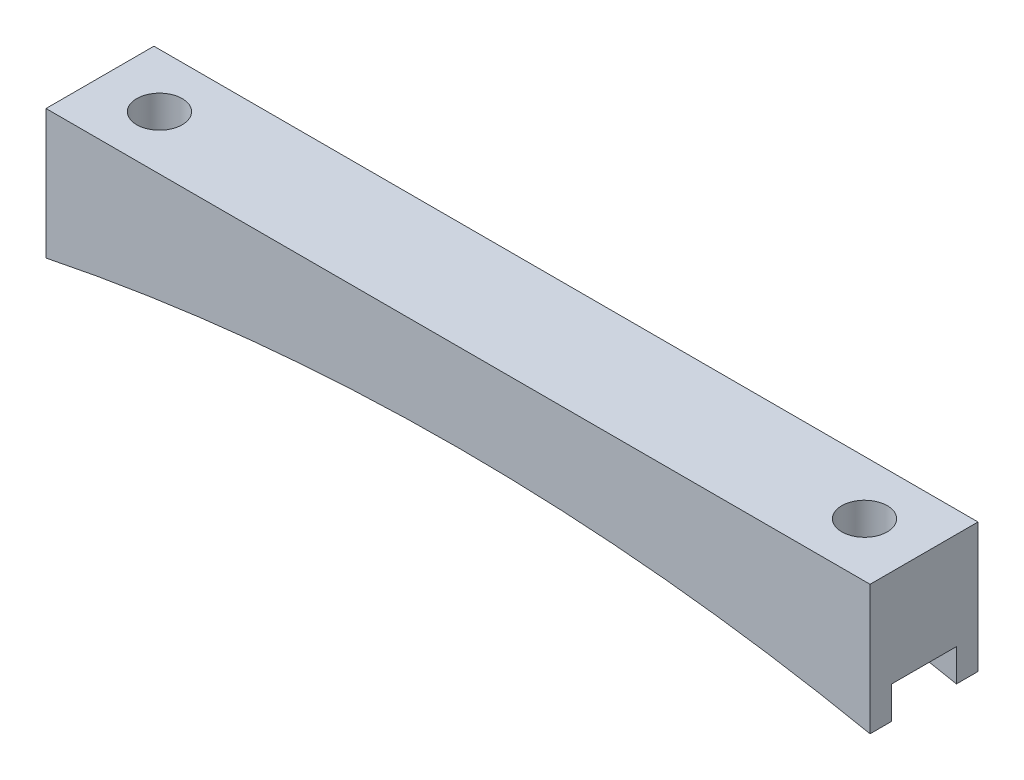
ISO-10303-21;
HEADER;
FILE_DESCRIPTION(('STEP AP214'),'2;1');
FILE_NAME('part.step','',(''),(''),'','','');
FILE_SCHEMA(('AUTOMOTIVE_DESIGN { 1 0 10303 214 1 1 1 1 }'));
ENDSEC;
DATA;
#1=APPLICATION_CONTEXT('core data for automotive mechanical design processes');
#2=APPLICATION_PROTOCOL_DEFINITION('international standard','automotive_design',2000,#1);
#3=PRODUCT_CONTEXT('',#1,'mechanical');
#4=PRODUCT('Part','Part','',(#3));
#5=PRODUCT_RELATED_PRODUCT_CATEGORY('part','',(#4));
#6=PRODUCT_DEFINITION_FORMATION('','',#4);
#7=PRODUCT_DEFINITION_CONTEXT('part definition',#1,'design');
#8=PRODUCT_DEFINITION('design','',#6,#7);
#9=PRODUCT_DEFINITION_SHAPE('','',#8);
#10=(LENGTH_UNIT() NAMED_UNIT(*) SI_UNIT(.MILLI.,.METRE.));
#11=(NAMED_UNIT(*) PLANE_ANGLE_UNIT() SI_UNIT($,.RADIAN.));
#12=(NAMED_UNIT(*) SI_UNIT($,.STERADIAN.) SOLID_ANGLE_UNIT());
#13=UNCERTAINTY_MEASURE_WITH_UNIT(LENGTH_MEASURE(1.E-05),#10,'distance_accuracy_value','');
#14=(GEOMETRIC_REPRESENTATION_CONTEXT(3) GLOBAL_UNCERTAINTY_ASSIGNED_CONTEXT((#13)) GLOBAL_UNIT_ASSIGNED_CONTEXT((#10,
#11,#12)) REPRESENTATION_CONTEXT('',''));
#15=CARTESIAN_POINT('',(0.,0.,0.));
#16=DIRECTION('',(0.,0.,1.));
#17=DIRECTION('',(1.,0.,0.));
#18=AXIS2_PLACEMENT_3D('',#15,#16,#17);
#19=CARTESIAN_POINT('',(48.485,0.,12.7));
#20=DIRECTION('',(-1.,0.,0.));
#21=DIRECTION('',(0.,0.,1.));
#22=AXIS2_PLACEMENT_3D('',#19,#20,#21);
#23=PLANE('',#22);
#24=DIRECTION('',(0.,0.,-1.));
#25=VECTOR('',#24,1.);
#26=CARTESIAN_POINT('',(48.485,-15.24,12.7));
#27=LINE('',#26,#25);
#28=CARTESIAN_POINT('',(48.485,-15.24,12.7));
#29=VERTEX_POINT('',#28);
#30=CARTESIAN_POINT('',(48.485,-15.24,10.16));
#31=VERTEX_POINT('',#30);
#32=EDGE_CURVE('E156',#29,#31,#27,.T.);
#33=ORIENTED_EDGE('',*,*,#32,.T.);
#34=DIRECTION('',(0.,-1.,0.));
#35=VECTOR('',#34,1.);
#36=CARTESIAN_POINT('',(48.485,-15.24,10.16));
#37=LINE('',#36,#35);
#38=CARTESIAN_POINT('',(48.485,-11.43,10.16));
#39=VERTEX_POINT('',#38);
#40=EDGE_CURVE('E185',#39,#31,#37,.T.);
#41=ORIENTED_EDGE('',*,*,#40,.F.);
#42=DIRECTION('',(0.,0.,1.));
#43=VECTOR('',#42,1.);
#44=CARTESIAN_POINT('',(48.485,-11.43,10.16));
#45=LINE('',#44,#43);
#46=CARTESIAN_POINT('',(48.485,-11.43,2.54));
#47=VERTEX_POINT('',#46);
#48=EDGE_CURVE('E141',#47,#39,#45,.T.);
#49=ORIENTED_EDGE('',*,*,#48,.F.);
#50=DIRECTION('',(0.,1.,0.));
#51=VECTOR('',#50,1.);
#52=CARTESIAN_POINT('',(48.485,-15.24,2.54));
#53=LINE('',#52,#51);
#54=CARTESIAN_POINT('',(48.485,-15.24,2.54));
#55=VERTEX_POINT('',#54);
#56=EDGE_CURVE('E177',#55,#47,#53,.T.);
#57=ORIENTED_EDGE('',*,*,#56,.F.);
#58=CARTESIAN_POINT('',(48.485,-15.24,0.));
#59=VERTEX_POINT('',#58);
#60=EDGE_CURVE('E174',#55,#59,#27,.T.);
#61=ORIENTED_EDGE('',*,*,#60,.T.);
#62=DIRECTION('',(0.,1.,0.));
#63=VECTOR('',#62,1.);
#64=CARTESIAN_POINT('',(48.485,0.,0.));
#65=LINE('',#64,#63);
#66=CARTESIAN_POINT('',(48.485,0.,0.));
#67=VERTEX_POINT('',#66);
#68=EDGE_CURVE('E213',#59,#67,#65,.T.);
#69=ORIENTED_EDGE('',*,*,#68,.T.);
#70=DIRECTION('',(0.,0.,-1.));
#71=VECTOR('',#70,1.);
#72=CARTESIAN_POINT('',(48.485,0.,12.7));
#73=LINE('',#72,#71);
#74=CARTESIAN_POINT('',(48.485,0.,12.7));
#75=VERTEX_POINT('',#74);
#76=EDGE_CURVE('E154',#75,#67,#73,.T.);
#77=ORIENTED_EDGE('',*,*,#76,.F.);
#78=DIRECTION('',(0.,1.,0.));
#79=VECTOR('',#78,1.);
#80=CARTESIAN_POINT('',(48.485,0.,12.7));
#81=LINE('',#80,#79);
#82=EDGE_CURVE('E217',#29,#75,#81,.T.);
#83=ORIENTED_EDGE('',*,*,#82,.F.);
#84=EDGE_LOOP('',(#33,#41,#49,#57,#61,#69,#77,#83));
#85=FACE_BOUND('',#84,.T.);
#86=ADVANCED_FACE('F43',(#85),#23,.F.);
#87=CARTESIAN_POINT('',(-48.485,0.,12.7));
#88=DIRECTION('',(0.,-1.,0.));
#89=DIRECTION('',(1.,0.,0.));
#90=AXIS2_PLACEMENT_3D('',#87,#88,#89);
#91=PLANE('',#90);
#92=CARTESIAN_POINT('',(-41.485,0.,6.35));
#93=DIRECTION('',(0.,1.,0.));
#94=DIRECTION('',(-1.,0.,0.));
#95=AXIS2_PLACEMENT_3D('',#92,#93,#94);
#96=CIRCLE('',#95,2.675);
#97=CARTESIAN_POINT('',(-44.16,0.,6.35));
#98=VERTEX_POINT('',#97);
#99=EDGE_CURVE('E209',#98,#98,#96,.T.);
#100=ORIENTED_EDGE('',*,*,#99,.F.);
#101=EDGE_LOOP('',(#100));
#102=FACE_BOUND('',#101,.T.);
#103=CARTESIAN_POINT('',(41.485,0.,6.35));
#104=DIRECTION('',(0.,1.,0.));
#105=DIRECTION('',(-1.,0.,0.));
#106=AXIS2_PLACEMENT_3D('',#103,#104,#105);
#107=CIRCLE('',#106,2.675);
#108=CARTESIAN_POINT('',(38.81,0.,6.35));
#109=VERTEX_POINT('',#108);
#110=EDGE_CURVE('E208',#109,#109,#107,.T.);
#111=ORIENTED_EDGE('',*,*,#110,.F.);
#112=EDGE_LOOP('',(#111));
#113=FACE_BOUND('',#112,.T.);
#114=DIRECTION('',(-1.,0.,0.));
#115=VECTOR('',#114,1.);
#116=CARTESIAN_POINT('',(-48.485,0.,0.));
#117=LINE('',#116,#115);
#118=CARTESIAN_POINT('',(-48.485,0.,0.));
#119=VERTEX_POINT('',#118);
#120=EDGE_CURVE('E232',#67,#119,#117,.T.);
#121=ORIENTED_EDGE('',*,*,#120,.T.);
#122=DIRECTION('',(0.,0.,-1.));
#123=VECTOR('',#122,1.);
#124=CARTESIAN_POINT('',(-48.485,0.,12.7));
#125=LINE('',#124,#123);
#126=CARTESIAN_POINT('',(-48.485,0.,12.7));
#127=VERTEX_POINT('',#126);
#128=EDGE_CURVE('E148',#127,#119,#125,.T.);
#129=ORIENTED_EDGE('',*,*,#128,.F.);
#130=DIRECTION('',(-1.,0.,0.));
#131=VECTOR('',#130,1.);
#132=CARTESIAN_POINT('',(-48.485,0.,12.7));
#133=LINE('',#132,#131);
#134=EDGE_CURVE('E221',#75,#127,#133,.T.);
#135=ORIENTED_EDGE('',*,*,#134,.F.);
#136=ORIENTED_EDGE('',*,*,#76,.T.);
#137=EDGE_LOOP('',(#121,#129,#135,#136));
#138=FACE_BOUND('',#137,.T.);
#139=ADVANCED_FACE('F247',(#102,#113,#138),#91,.F.);
#140=CARTESIAN_POINT('',(-48.485,0.,12.7));
#141=DIRECTION('',(1.,0.,0.));
#142=DIRECTION('',(0.,0.,-1.));
#143=AXIS2_PLACEMENT_3D('',#140,#141,#142);
#144=PLANE('',#143);
#145=DIRECTION('',(0.,0.,1.));
#146=VECTOR('',#145,1.);
#147=CARTESIAN_POINT('',(-48.485,-11.43,10.16));
#148=LINE('',#147,#146);
#149=CARTESIAN_POINT('',(-48.485,-11.43,2.54));
#150=VERTEX_POINT('',#149);
#151=CARTESIAN_POINT('',(-48.485,-11.43,10.16));
#152=VERTEX_POINT('',#151);
#153=EDGE_CURVE('E139',#150,#152,#148,.T.);
#154=ORIENTED_EDGE('',*,*,#153,.T.);
#155=DIRECTION('',(0.,-1.,0.));
#156=VECTOR('',#155,1.);
#157=CARTESIAN_POINT('',(-48.485,-15.24,10.16));
#158=LINE('',#157,#156);
#159=CARTESIAN_POINT('',(-48.485,-15.24,10.16));
#160=VERTEX_POINT('',#159);
#161=EDGE_CURVE('E124',#152,#160,#158,.T.);
#162=ORIENTED_EDGE('',*,*,#161,.T.);
#163=DIRECTION('',(0.,0.,-1.));
#164=VECTOR('',#163,1.);
#165=CARTESIAN_POINT('',(-48.485,-15.24,12.7));
#166=LINE('',#165,#164);
#167=CARTESIAN_POINT('',(-48.485,-15.24,12.7));
#168=VERTEX_POINT('',#167);
#169=EDGE_CURVE('E136',#168,#160,#166,.T.);
#170=ORIENTED_EDGE('',*,*,#169,.F.);
#171=DIRECTION('',(0.,-1.,0.));
#172=VECTOR('',#171,1.);
#173=CARTESIAN_POINT('',(-48.485,0.,12.7));
#174=LINE('',#173,#172);
#175=EDGE_CURVE('E225',#127,#168,#174,.T.);
#176=ORIENTED_EDGE('',*,*,#175,.F.);
#177=ORIENTED_EDGE('',*,*,#128,.T.);
#178=DIRECTION('',(0.,-1.,0.));
#179=VECTOR('',#178,1.);
#180=CARTESIAN_POINT('',(-48.485,0.,0.));
#181=LINE('',#180,#179);
#182=CARTESIAN_POINT('',(-48.485,-15.24,0.));
#183=VERTEX_POINT('',#182);
#184=EDGE_CURVE('E235',#119,#183,#181,.T.);
#185=ORIENTED_EDGE('',*,*,#184,.T.);
#186=CARTESIAN_POINT('',(-48.485,-15.24,2.54));
#187=VERTEX_POINT('',#186);
#188=EDGE_CURVE('E149',#187,#183,#166,.T.);
#189=ORIENTED_EDGE('',*,*,#188,.F.);
#190=DIRECTION('',(0.,1.,0.));
#191=VECTOR('',#190,1.);
#192=CARTESIAN_POINT('',(-48.485,-15.24,2.54));
#193=LINE('',#192,#191);
#194=EDGE_CURVE('E67',#187,#150,#193,.T.);
#195=ORIENTED_EDGE('',*,*,#194,.T.);
#196=EDGE_LOOP('',(#154,#162,#170,#176,#177,#185,#189,#195));
#197=FACE_BOUND('',#196,.T.);
#198=ADVANCED_FACE('F134',(#197),#144,.F.);
#199=CARTESIAN_POINT('',(0.,-251.61871049441,12.7));
#200=DIRECTION('',(0.,0.,-1.));
#201=DIRECTION('',(-1.,0.,0.));
#202=AXIS2_PLACEMENT_3D('',#199,#200,#201);
#203=CYLINDRICAL_SURFACE('',#202,241.3);
#204=DIRECTION('',(0.,0.,-1.));
#205=VECTOR('',#204,1.);
#206=CARTESIAN_POINT('',(23.1316525789357,-11.43,12.7));
#207=LINE('',#206,#205);
#208=CARTESIAN_POINT('',(23.1316525789357,-11.43,2.54));
#209=VERTEX_POINT('',#208);
#210=CARTESIAN_POINT('',(23.1316525789357,-11.43,10.16));
#211=VERTEX_POINT('',#210);
#212=EDGE_CURVE('E172',#209,#211,#207,.F.);
#213=ORIENTED_EDGE('',*,*,#212,.T.);
#214=CARTESIAN_POINT('',(0.,-251.61871049441,10.16));
#215=DIRECTION('',(0.,0.,1.));
#216=DIRECTION('',(1.,0.,0.));
#217=AXIS2_PLACEMENT_3D('',#214,#215,#216);
#218=CIRCLE('',#217,241.3);
#219=EDGE_CURVE('E11',#211,#31,#218,.F.);
#220=ORIENTED_EDGE('',*,*,#219,.T.);
#221=ORIENTED_EDGE('',*,*,#32,.F.);
#222=CARTESIAN_POINT('',(0.,-251.61871049441,12.7));
#223=DIRECTION('',(0.,0.,-1.));
#224=DIRECTION('',(-1.,0.,0.));
#225=AXIS2_PLACEMENT_3D('',#222,#223,#224);
#226=CIRCLE('',#225,241.3);
#227=EDGE_CURVE('E146',#168,#29,#226,.T.);
#228=ORIENTED_EDGE('',*,*,#227,.F.);
#229=ORIENTED_EDGE('',*,*,#169,.T.);
#230=CARTESIAN_POINT('',(-23.1316525789357,-11.43,10.16));
#231=VERTEX_POINT('',#230);
#232=EDGE_CURVE('E46',#160,#231,#218,.F.);
#233=ORIENTED_EDGE('',*,*,#232,.T.);
#234=DIRECTION('',(0.,0.,-1.));
#235=VECTOR('',#234,1.);
#236=CARTESIAN_POINT('',(-23.1316525789357,-11.43,12.7));
#237=LINE('',#236,#235);
#238=CARTESIAN_POINT('',(-23.1316525789357,-11.43,2.54));
#239=VERTEX_POINT('',#238);
#240=EDGE_CURVE('E203',#231,#239,#237,.T.);
#241=ORIENTED_EDGE('',*,*,#240,.T.);
#242=CARTESIAN_POINT('',(0.,-251.61871049441,2.54));
#243=DIRECTION('',(0.,0.,-1.));
#244=DIRECTION('',(-1.,0.,0.));
#245=AXIS2_PLACEMENT_3D('',#242,#243,#244);
#246=CIRCLE('',#245,241.3);
#247=EDGE_CURVE('E131',#239,#187,#246,.F.);
#248=ORIENTED_EDGE('',*,*,#247,.T.);
#249=ORIENTED_EDGE('',*,*,#188,.T.);
#250=CARTESIAN_POINT('',(0.,-251.61871049441,0.));
#251=DIRECTION('',(0.,0.,-1.));
#252=DIRECTION('',(-1.,0.,0.));
#253=AXIS2_PLACEMENT_3D('',#250,#251,#252);
#254=CIRCLE('',#253,241.3);
#255=EDGE_CURVE('E222',#183,#59,#254,.T.);
#256=ORIENTED_EDGE('',*,*,#255,.T.);
#257=ORIENTED_EDGE('',*,*,#60,.F.);
#258=EDGE_CURVE('E52',#55,#209,#246,.F.);
#259=ORIENTED_EDGE('',*,*,#258,.T.);
#260=EDGE_LOOP('',(#213,#220,#221,#228,#229,#233,#241,#248,#249,#256,#257,#259));
#261=FACE_BOUND('',#260,.T.);
#262=ADVANCED_FACE('F144',(#261),#203,.F.);
#263=CARTESIAN_POINT('',(0.,-251.61871049441,12.7));
#264=DIRECTION('',(0.,0.,-1.));
#265=DIRECTION('',(-1.,0.,0.));
#266=AXIS2_PLACEMENT_3D('',#263,#264,#265);
#267=PLANE('',#266);
#268=ORIENTED_EDGE('',*,*,#82,.T.);
#269=ORIENTED_EDGE('',*,*,#134,.T.);
#270=ORIENTED_EDGE('',*,*,#175,.T.);
#271=ORIENTED_EDGE('',*,*,#227,.T.);
#272=EDGE_LOOP('',(#268,#269,#270,#271));
#273=FACE_BOUND('',#272,.T.);
#274=ADVANCED_FACE('F250',(#273),#267,.F.);
#275=CARTESIAN_POINT('',(0.,-251.61871049441,0.));
#276=DIRECTION('',(0.,0.,-1.));
#277=DIRECTION('',(-1.,0.,0.));
#278=AXIS2_PLACEMENT_3D('',#275,#276,#277);
#279=PLANE('',#278);
#280=ORIENTED_EDGE('',*,*,#68,.F.);
#281=ORIENTED_EDGE('',*,*,#255,.F.);
#282=ORIENTED_EDGE('',*,*,#184,.F.);
#283=ORIENTED_EDGE('',*,*,#120,.F.);
#284=EDGE_LOOP('',(#280,#281,#282,#283));
#285=FACE_BOUND('',#284,.T.);
#286=ADVANCED_FACE('F243',(#285),#279,.T.);
#287=CARTESIAN_POINT('',(41.485,-15.24,6.35));
#288=DIRECTION('',(0.,1.,0.));
#289=DIRECTION('',(-1.,0.,0.));
#290=AXIS2_PLACEMENT_3D('',#287,#288,#289);
#291=CYLINDRICAL_SURFACE('',#290,2.675);
#292=CARTESIAN_POINT('',(41.485,-11.43,6.35));
#293=DIRECTION('',(0.,1.,0.));
#294=DIRECTION('',(0.,0.,1.));
#295=AXIS2_PLACEMENT_3D('',#292,#293,#294);
#296=CIRCLE('',#295,2.675);
#297=CARTESIAN_POINT('',(41.485,-11.43,9.025));
#298=VERTEX_POINT('',#297);
#299=EDGE_CURVE('E166',#298,#298,#296,.F.);
#300=ORIENTED_EDGE('',*,*,#299,.T.);
#301=EDGE_LOOP('',(#300));
#302=FACE_BOUND('',#301,.T.);
#303=ORIENTED_EDGE('',*,*,#110,.T.);
#304=EDGE_LOOP('',(#303));
#305=FACE_BOUND('',#304,.T.);
#306=ADVANCED_FACE('F292',(#302,#305),#291,.F.);
#307=CARTESIAN_POINT('',(-41.485,-15.24,6.35));
#308=DIRECTION('',(0.,1.,0.));
#309=DIRECTION('',(-1.,0.,0.));
#310=AXIS2_PLACEMENT_3D('',#307,#308,#309);
#311=CYLINDRICAL_SURFACE('',#310,2.675);
#312=CARTESIAN_POINT('',(-41.485,-11.43,6.35));
#313=DIRECTION('',(0.,1.,0.));
#314=DIRECTION('',(0.,0.,1.));
#315=AXIS2_PLACEMENT_3D('',#312,#313,#314);
#316=CIRCLE('',#315,2.675);
#317=CARTESIAN_POINT('',(-41.485,-11.43,9.025));
#318=VERTEX_POINT('',#317);
#319=EDGE_CURVE('E163',#318,#318,#316,.F.);
#320=ORIENTED_EDGE('',*,*,#319,.T.);
#321=EDGE_LOOP('',(#320));
#322=FACE_BOUND('',#321,.T.);
#323=ORIENTED_EDGE('',*,*,#99,.T.);
#324=EDGE_LOOP('',(#323));
#325=FACE_BOUND('',#324,.T.);
#326=ADVANCED_FACE('F274',(#322,#325),#311,.F.);
#327=CARTESIAN_POINT('',(-48.485,-11.43,10.16));
#328=DIRECTION('',(0.,1.,0.));
#329=DIRECTION('',(0.,0.,1.));
#330=AXIS2_PLACEMENT_3D('',#327,#328,#329);
#331=PLANE('',#330);
#332=ORIENTED_EDGE('',*,*,#319,.F.);
#333=EDGE_LOOP('',(#332));
#334=FACE_BOUND('',#333,.T.);
#335=DIRECTION('',(1.,0.,0.));
#336=VECTOR('',#335,1.);
#337=CARTESIAN_POINT('',(-48.485,-11.43,10.16));
#338=LINE('',#337,#336);
#339=EDGE_CURVE('E126',#152,#231,#338,.T.);
#340=ORIENTED_EDGE('',*,*,#339,.F.);
#341=ORIENTED_EDGE('',*,*,#153,.F.);
#342=DIRECTION('',(1.,0.,0.));
#343=VECTOR('',#342,1.);
#344=CARTESIAN_POINT('',(-48.485,-11.43,2.54));
#345=LINE('',#344,#343);
#346=EDGE_CURVE('E196',#150,#239,#345,.T.);
#347=ORIENTED_EDGE('',*,*,#346,.T.);
#348=ORIENTED_EDGE('',*,*,#240,.F.);
#349=EDGE_LOOP('',(#340,#341,#347,#348));
#350=FACE_BOUND('',#349,.T.);
#351=ADVANCED_FACE('F266',(#334,#350),#331,.F.);
#352=CARTESIAN_POINT('',(-48.485,-15.24,2.54));
#353=DIRECTION('',(0.,0.,-1.));
#354=DIRECTION('',(-1.,0.,0.));
#355=AXIS2_PLACEMENT_3D('',#352,#353,#354);
#356=PLANE('',#355);
#357=ORIENTED_EDGE('',*,*,#346,.F.);
#358=ORIENTED_EDGE('',*,*,#194,.F.);
#359=ORIENTED_EDGE('',*,*,#247,.F.);
#360=EDGE_LOOP('',(#357,#358,#359));
#361=FACE_BOUND('',#360,.T.);
#362=ADVANCED_FACE('F271',(#361),#356,.F.);
#363=CARTESIAN_POINT('',(-48.485,-15.24,10.16));
#364=DIRECTION('',(0.,0.,1.));
#365=DIRECTION('',(1.,0.,0.));
#366=AXIS2_PLACEMENT_3D('',#363,#364,#365);
#367=PLANE('',#366);
#368=ORIENTED_EDGE('',*,*,#161,.F.);
#369=ORIENTED_EDGE('',*,*,#339,.T.);
#370=ORIENTED_EDGE('',*,*,#232,.F.);
#371=EDGE_LOOP('',(#368,#369,#370));
#372=FACE_BOUND('',#371,.T.);
#373=ADVANCED_FACE('F123',(#372),#367,.F.);
#374=EDGE_CURVE('E195',#211,#39,#338,.T.);
#375=ORIENTED_EDGE('',*,*,#374,.T.);
#376=ORIENTED_EDGE('',*,*,#40,.T.);
#377=ORIENTED_EDGE('',*,*,#219,.F.);
#378=EDGE_LOOP('',(#375,#376,#377));
#379=FACE_BOUND('',#378,.T.);
#380=ADVANCED_FACE('F254',(#379),#367,.F.);
#381=ORIENTED_EDGE('',*,*,#56,.T.);
#382=EDGE_CURVE('E59',#209,#47,#345,.T.);
#383=ORIENTED_EDGE('',*,*,#382,.F.);
#384=ORIENTED_EDGE('',*,*,#258,.F.);
#385=EDGE_LOOP('',(#381,#383,#384));
#386=FACE_BOUND('',#385,.T.);
#387=ADVANCED_FACE('F176',(#386),#356,.F.);
#388=ORIENTED_EDGE('',*,*,#299,.F.);
#389=EDGE_LOOP('',(#388));
#390=FACE_BOUND('',#389,.T.);
#391=ORIENTED_EDGE('',*,*,#382,.T.);
#392=ORIENTED_EDGE('',*,*,#48,.T.);
#393=ORIENTED_EDGE('',*,*,#374,.F.);
#394=ORIENTED_EDGE('',*,*,#212,.F.);
#395=EDGE_LOOP('',(#391,#392,#393,#394));
#396=FACE_BOUND('',#395,.T.);
#397=ADVANCED_FACE('F258',(#390,#396),#331,.F.);
#398=CLOSED_SHELL('',(#86,#139,#198,#262,#274,#286,#306,#326,#351,#362,#373,#380,#387,#397));
#399=MANIFOLD_SOLID_BREP('B2',#398);
#400=ADVANCED_BREP_SHAPE_REPRESENTATION('',(#18,#399),#14);
#401=SHAPE_DEFINITION_REPRESENTATION(#9,#400);
ENDSEC;
END-ISO-10303-21;
